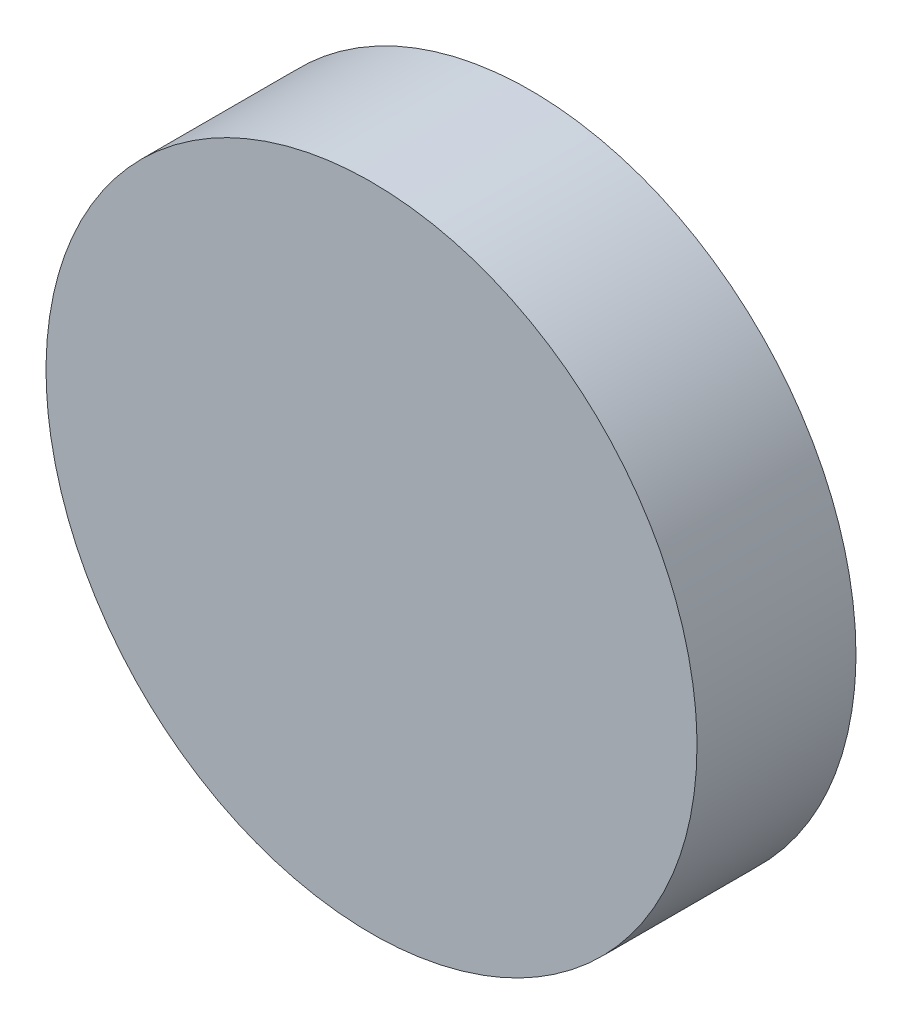
ISO-10303-21;
HEADER;
FILE_DESCRIPTION(('STEP AP214'),'2;1');
FILE_NAME('part.step','',(''),(''),'','','');
FILE_SCHEMA(('AUTOMOTIVE_DESIGN { 1 0 10303 214 1 1 1 1 }'));
ENDSEC;
DATA;
#1=APPLICATION_CONTEXT('core data for automotive mechanical design processes');
#2=APPLICATION_PROTOCOL_DEFINITION('international standard','automotive_design',2000,#1);
#3=PRODUCT_CONTEXT('',#1,'mechanical');
#4=PRODUCT('Part','Part','',(#3));
#5=PRODUCT_RELATED_PRODUCT_CATEGORY('part','',(#4));
#6=PRODUCT_DEFINITION_FORMATION('','',#4);
#7=PRODUCT_DEFINITION_CONTEXT('part definition',#1,'design');
#8=PRODUCT_DEFINITION('design','',#6,#7);
#9=PRODUCT_DEFINITION_SHAPE('','',#8);
#10=(LENGTH_UNIT() NAMED_UNIT(*) SI_UNIT(.MILLI.,.METRE.));
#11=(NAMED_UNIT(*) PLANE_ANGLE_UNIT() SI_UNIT($,.RADIAN.));
#12=(NAMED_UNIT(*) SI_UNIT($,.STERADIAN.) SOLID_ANGLE_UNIT());
#13=UNCERTAINTY_MEASURE_WITH_UNIT(LENGTH_MEASURE(1.E-05),#10,'distance_accuracy_value','');
#14=(GEOMETRIC_REPRESENTATION_CONTEXT(3) GLOBAL_UNCERTAINTY_ASSIGNED_CONTEXT((#13)) GLOBAL_UNIT_ASSIGNED_CONTEXT((#10,
#11,#12)) REPRESENTATION_CONTEXT('',''));
#15=CARTESIAN_POINT('',(0.,0.,0.));
#16=DIRECTION('',(0.,0.,1.));
#17=DIRECTION('',(1.,0.,0.));
#18=AXIS2_PLACEMENT_3D('',#15,#16,#17);
#19=CARTESIAN_POINT('',(-13.1496363943217,2.89844450659047,33.9946065263124));
#20=CARTESIAN_POINT('',(-13.1496363943217,3.16761247332292,33.9946065263124));
#21=CARTESIAN_POINT('',(-13.2567180692927,3.70594840678783,33.9946065263124));
#22=CARTESIAN_POINT('',(-13.7141322851876,4.39051715822122,33.9946065263124));
#23=CARTESIAN_POINT('',(-14.398701036621,4.8479313741161,33.9946065263124));
#24=CARTESIAN_POINT('',(-15.2062049368183,5.00855388657266,33.9946065263124));
#25=CARTESIAN_POINT('',(-16.0137088370157,4.8479313741161,33.9946065263124));
#26=CARTESIAN_POINT('',(-16.6982775884491,4.39051715822122,33.9946065263124));
#27=CARTESIAN_POINT('',(-17.155691804344,3.70594840678783,33.9946065263124));
#28=CARTESIAN_POINT('',(-17.3163143168005,2.89844450659047,33.9946065263124));
#29=CARTESIAN_POINT('',(-17.155691804344,2.09094060639311,33.9946065263124));
#30=CARTESIAN_POINT('',(-16.6982775884491,1.40637185495972,33.9946065263124));
#31=CARTESIAN_POINT('',(-16.0137088370157,0.948957639064841,33.9946065263124));
#32=CARTESIAN_POINT('',(-15.2062049368183,0.788335126608277,33.9946065263124));
#33=CARTESIAN_POINT('',(-14.398701036621,0.948957639064841,33.9946065263124));
#34=CARTESIAN_POINT('',(-13.7141322851876,1.40637185495972,33.9946065263124));
#35=CARTESIAN_POINT('',(-13.2567180692927,2.09094060639311,33.9946065263124));
#36=CARTESIAN_POINT('',(-13.1496363943217,2.62927653985802,33.9946065263124));
#37=CARTESIAN_POINT('',(-13.1496363943217,2.89844450659047,33.9946065263124));
#38=B_SPLINE_CURVE_WITH_KNOTS('',3,(#19,#20,#21,#22,#23,#24,#25,#26,#27,#28,#29,#30,#31,#32,#33,
#34,#35,#36,#37),.UNSPECIFIED.,.T.,.F.,(4,1,1,1,1,1,1,1,1,1,1,1,1,1,1,1,4),(0.,0.0625,0.125,
0.1875,0.25,0.3125,0.375,0.4375,0.5,0.5625,0.625,0.6875,0.75,0.8125,0.875,0.9375,1.),.UNSPECIFIED.);
#39=DIRECTION('',(0.,0.,1.));
#40=VECTOR('',#39,1.);
#41=SURFACE_OF_LINEAR_EXTRUSION('',#38,#40);
#42=CARTESIAN_POINT('',(-13.1496363943217,2.89844450659047,33.9946065263124));
#43=CARTESIAN_POINT('',(-13.1496363943217,3.16761247332292,33.9946065263124));
#44=CARTESIAN_POINT('',(-13.2567180692927,3.70594840678783,33.9946065263124));
#45=CARTESIAN_POINT('',(-13.7141322851876,4.39051715822122,33.9946065263124));
#46=CARTESIAN_POINT('',(-14.398701036621,4.8479313741161,33.9946065263124));
#47=CARTESIAN_POINT('',(-15.2062049368183,5.00855388657266,33.9946065263124));
#48=CARTESIAN_POINT('',(-16.0137088370157,4.8479313741161,33.9946065263124));
#49=CARTESIAN_POINT('',(-16.6982775884491,4.39051715822122,33.9946065263124));
#50=CARTESIAN_POINT('',(-17.155691804344,3.70594840678783,33.9946065263124));
#51=CARTESIAN_POINT('',(-17.3163143168005,2.89844450659047,33.9946065263124));
#52=CARTESIAN_POINT('',(-17.155691804344,2.09094060639311,33.9946065263124));
#53=CARTESIAN_POINT('',(-16.6982775884491,1.40637185495972,33.9946065263124));
#54=CARTESIAN_POINT('',(-16.0137088370157,0.948957639064841,33.9946065263124));
#55=CARTESIAN_POINT('',(-15.2062049368183,0.788335126608277,33.9946065263124));
#56=CARTESIAN_POINT('',(-14.398701036621,0.948957639064841,33.9946065263124));
#57=CARTESIAN_POINT('',(-13.7141322851876,1.40637185495972,33.9946065263124));
#58=CARTESIAN_POINT('',(-13.2567180692927,2.09094060639311,33.9946065263124));
#59=CARTESIAN_POINT('',(-13.1496363943217,2.62927653985802,33.9946065263124));
#60=CARTESIAN_POINT('',(-13.1496363943217,2.89844450659047,33.9946065263124));
#61=B_SPLINE_CURVE_WITH_KNOTS('',3,(#42,#43,#44,#45,#46,#47,#48,#49,#50,#51,#52,#53,#54,#55,#56,
#57,#58,#59,#60),.UNSPECIFIED.,.T.,.F.,(4,1,1,1,1,1,1,1,1,1,1,1,1,1,1,1,4),(0.,0.0625,0.125,
0.1875,0.25,0.3125,0.375,0.4375,0.5,0.5625,0.625,0.6875,0.75,0.8125,0.875,0.9375,1.),.UNSPECIFIED.);
#62=CARTESIAN_POINT('',(-13.1496363943217,2.89844450659047,33.9946065263124));
#63=VERTEX_POINT('',#62);
#64=EDGE_CURVE('E9',#63,#63,#61,.T.);
#65=ORIENTED_EDGE('',*,*,#64,.T.);
#66=EDGE_LOOP('',(#65));
#67=FACE_BOUND('',#66,.T.);
#68=CARTESIAN_POINT('',(-13.1496363943217,2.89844450659047,34.9990000000068));
#69=CARTESIAN_POINT('',(-13.1496363699629,2.86479771684749,34.9990000000068));
#70=CARTESIAN_POINT('',(-13.1504730064724,2.83115162548501,34.9990000000068));
#71=CARTESIAN_POINT('',(-13.1538034135198,2.76393947146804,34.9990000000068));
#72=CARTESIAN_POINT('',(-13.1562972815486,2.73037341363833,34.9990000000068));
#73=CARTESIAN_POINT('',(-13.1629261875652,2.66340163862288,34.9990000000068));
#74=CARTESIAN_POINT('',(-13.1670613381745,2.62999593259941,34.9990000000068));
#75=CARTESIAN_POINT('',(-13.1769569019658,2.56342468915356,34.9990000000068));
#76=CARTESIAN_POINT('',(-13.1827173852433,2.53025916215264,34.9990000000068));
#77=CARTESIAN_POINT('',(-13.1958477712335,2.46424824869611,34.9990000000068));
#78=CARTESIAN_POINT('',(-13.2032176739464,2.43140286224051,34.9990000000068));
#79=CARTESIAN_POINT('',(-13.2195510839073,2.36611217178674,34.9990000000068));
#80=CARTESIAN_POINT('',(-13.2285145224069,2.33366685059351,34.9990000000068));
#81=CARTESIAN_POINT('',(-13.2480191751394,2.26925627775602,34.9990000000068));
#82=CARTESIAN_POINT('',(-13.2585602810548,2.23729099331971,34.9990000000068));
#83=CARTESIAN_POINT('',(-13.2812044587058,2.17392037371882,34.9990000000068));
#84=CARTESIAN_POINT('',(-13.2933074385154,2.14251500572341,34.9990000000068));
#85=CARTESIAN_POINT('',(-13.3190592678828,2.08034458998414,34.9990000000068));
#86=CARTESIAN_POINT('',(-13.3327081174406,2.04957954224029,34.9990000000068));
#87=CARTESIAN_POINT('',(-13.3615060607773,1.98875789577373,34.9990000000068));
#88=CARTESIAN_POINT('',(-13.3766552427726,1.95870133883757,34.9990000000068));
#89=CARTESIAN_POINT('',(-13.4084085231704,1.89936431398903,34.9990000000068));
#90=CARTESIAN_POINT('',(-13.4250127213523,1.87008389948112,34.9990000000068));
#91=CARTESIAN_POINT('',(-13.4596307472126,1.8123669438299,34.9990000000068));
#92=CARTESIAN_POINT('',(-13.4776446356623,1.78393043914022,34.9990000000068));
#93=CARTESIAN_POINT('',(-13.5150368121087,1.72796909239188,34.9990000000068));
#94=CARTESIAN_POINT('',(-13.5344151001053,1.70044425033323,34.9990000000068));
#95=CARTESIAN_POINT('',(-13.5744908691528,1.64637404209053,34.9990000000068));
#96=CARTESIAN_POINT('',(-13.5951882932687,1.61982863371135,34.9990000000068));
#97=CARTESIAN_POINT('',(-13.6378571017135,1.56778513152689,34.9990000000068));
#98=CARTESIAN_POINT('',(-13.6598283985191,1.54228696597445,34.9990000000068));
#99=CARTESIAN_POINT('',(-13.7049997770275,1.49240569911345,34.9990000000068));
#100=CARTESIAN_POINT('',(-13.7281997863655,1.46802253229461,34.9990000000068));
#101=CARTESIAN_POINT('',(-13.7757829625225,1.42043935613767,34.9990000000068));
#102=CARTESIAN_POINT('',(-13.8001661293413,1.39723934679959,34.9990000000068));
#103=CARTESIAN_POINT('',(-13.8500473962023,1.3520679682912,34.9990000000068));
#104=CARTESIAN_POINT('',(-13.8755455617548,1.33009667148559,34.9990000000068));
#105=CARTESIAN_POINT('',(-13.9275890639392,1.28742786304083,34.9990000000068));
#106=CARTESIAN_POINT('',(-13.9541344723184,1.26673043892492,34.9990000000068));
#107=CARTESIAN_POINT('',(-14.0082046805611,1.22665466987745,34.9990000000068));
#108=CARTESIAN_POINT('',(-14.0357295226198,1.20727638188081,34.9990000000068));
#109=CARTESIAN_POINT('',(-14.091690869368,1.16988420543445,34.9990000000068));
#110=CARTESIAN_POINT('',(-14.1201273740576,1.15187031698473,34.9990000000068));
#111=CARTESIAN_POINT('',(-14.1778443297092,1.1172522911244,34.9990000000068));
#112=CARTESIAN_POINT('',(-14.2071247442177,1.10064809294253,34.9990000000068));
#113=CARTESIAN_POINT('',(-14.2664617690647,1.06889481254468,34.9990000000068));
#114=CARTESIAN_POINT('',(-14.2965183259987,1.05374563054928,34.9990000000068));
#115=CARTESIAN_POINT('',(-14.357339972471,1.02494768721292,34.9990000000068));
#116=CARTESIAN_POINT('',(-14.3881050202227,1.01129883765558,34.9990000000068));
#117=CARTESIAN_POINT('',(-14.4502754359406,0.985547008286876,34.9990000000068));
#118=CARTESIAN_POINT('',(-14.4816808039067,0.973444028475515,34.9990000000068));
#119=CARTESIAN_POINT('',(-14.5450514235876,0.950799850829384,34.9990000000068));
#120=CARTESIAN_POINT('',(-14.5770167081331,0.940258744920572,34.9990000000068));
#121=CARTESIAN_POINT('',(-14.6414272806721,0.920754092170061,34.9990000000068));
#122=CARTESIAN_POINT('',(-14.6738726014576,0.911790653645731,34.9990000000068));
#123=CARTESIAN_POINT('',(-14.7391632930254,0.895457243752155,34.9990000000068));
#124=CARTESIAN_POINT('',(-14.772008681003,0.888087341131276,34.9990000000068));
#125=CARTESIAN_POINT('',(-14.8380195903015,0.874956954889819,34.9990000000068));
#126=CARTESIAN_POINT('',(-14.8711851116225,0.869196471269239,34.9990000000068));
#127=CARTESIAN_POINT('',(-14.9377563705859,0.85930090841536,34.9990000000068));
#128=CARTESIAN_POINT('',(-14.9711620978056,0.855165759086547,34.9990000000068));
#129=CARTESIAN_POINT('',(-15.0381338149133,0.84853684957166,34.9990000000068));
#130=CARTESIAN_POINT('',(-15.071699793646,0.846042976764422,34.9990000000068));
#131=CARTESIAN_POINT('',(-15.1389121637564,0.842712582771656,34.9990000000068));
#132=CARTESIAN_POINT('',(-15.1725585502874,0.841875964093798,34.9990000000068));
#133=CARTESIAN_POINT('',(-15.2398513233493,0.841875964093798,34.9990000000068));
#134=CARTESIAN_POINT('',(-15.2734977098803,0.842712582771656,34.9990000000068));
#135=CARTESIAN_POINT('',(-15.3407100799907,0.846042976764422,34.9990000000068));
#136=CARTESIAN_POINT('',(-15.3742760587233,0.84853684957166,34.9990000000068));
#137=CARTESIAN_POINT('',(-15.4412477758311,0.855165759086547,34.9990000000068));
#138=CARTESIAN_POINT('',(-15.4746535030508,0.85930090841536,34.9990000000068));
#139=CARTESIAN_POINT('',(-15.5412247620142,0.869196471269239,34.9990000000068));
#140=CARTESIAN_POINT('',(-15.5743902833352,0.874956954889818,34.9990000000068));
#141=CARTESIAN_POINT('',(-15.6404011926337,0.888087341131276,34.9990000000068));
#142=CARTESIAN_POINT('',(-15.6732465806113,0.895457243752154,34.9990000000068));
#143=CARTESIAN_POINT('',(-15.7385372721791,0.911790653645731,34.9990000000068));
#144=CARTESIAN_POINT('',(-15.7709825929646,0.920754092170061,34.9990000000068));
#145=CARTESIAN_POINT('',(-15.8353931655035,0.940258744920571,34.9990000000068));
#146=CARTESIAN_POINT('',(-15.8673584500491,0.950799850829384,34.9990000000068));
#147=CARTESIAN_POINT('',(-15.93072906973,0.973444028475515,34.9990000000068));
#148=CARTESIAN_POINT('',(-15.9621344376961,0.985547008286875,34.9990000000068));
#149=CARTESIAN_POINT('',(-16.024304853414,1.01129883765558,34.9990000000068));
#150=CARTESIAN_POINT('',(-16.0550699011656,1.02494768721292,34.9990000000068));
#151=CARTESIAN_POINT('',(-16.115891547638,1.05374563054928,34.9990000000068));
#152=CARTESIAN_POINT('',(-16.145948104572,1.06889481254468,34.9990000000068));
#153=CARTESIAN_POINT('',(-16.205285129419,1.10064809294253,34.9990000000068));
#154=CARTESIAN_POINT('',(-16.2345655439275,1.1172522911244,34.9990000000068));
#155=CARTESIAN_POINT('',(-16.2922824995791,1.15187031698473,34.9990000000068));
#156=CARTESIAN_POINT('',(-16.3207190042686,1.16988420543445,34.9990000000068));
#157=CARTESIAN_POINT('',(-16.3766803510169,1.20727638188081,34.9990000000068));
#158=CARTESIAN_POINT('',(-16.4042051930756,1.22665466987745,34.9990000000068));
#159=CARTESIAN_POINT('',(-16.4582754013183,1.26673043892492,34.9990000000068));
#160=CARTESIAN_POINT('',(-16.4848208096975,1.28742786304083,34.9990000000068));
#161=CARTESIAN_POINT('',(-16.5368643118819,1.33009667148559,34.9990000000068));
#162=CARTESIAN_POINT('',(-16.5623624774344,1.3520679682912,34.9990000000068));
#163=CARTESIAN_POINT('',(-16.6122437442954,1.39723934679959,34.9990000000068));
#164=CARTESIAN_POINT('',(-16.6366269111142,1.42043935613767,34.9990000000068));
#165=CARTESIAN_POINT('',(-16.6842100872711,1.46802253229461,34.9990000000068));
#166=CARTESIAN_POINT('',(-16.7074100966092,1.49240569911345,34.9990000000068));
#167=CARTESIAN_POINT('',(-16.7525814751176,1.54228696597445,34.9990000000068));
#168=CARTESIAN_POINT('',(-16.7745527719232,1.56778513152689,34.9990000000068));
#169=CARTESIAN_POINT('',(-16.817221580368,1.61982863371135,34.9990000000068));
#170=CARTESIAN_POINT('',(-16.8379190044839,1.64637404209051,34.9990000000068));
#171=CARTESIAN_POINT('',(-16.8779947735314,1.70044425033325,34.9990000000068));
#172=CARTESIAN_POINT('',(-16.897373061528,1.72796909239194,34.9990000000068));
#173=CARTESIAN_POINT('',(-16.9347652379744,1.78393043914016,34.9990000000068));
#174=CARTESIAN_POINT('',(-16.9527791264241,1.8123669438297,34.9990000000068));
#175=CARTESIAN_POINT('',(-16.9873971522844,1.87008389948133,34.9990000000068));
#176=CARTESIAN_POINT('',(-17.0040013504663,1.8993643139898,34.9990000000068));
#177=CARTESIAN_POINT('',(-17.0357546308641,1.9587013388368,34.9990000000068));
#178=CARTESIAN_POINT('',(-17.0509038128595,1.98875789577086,34.9990000000068));
#179=CARTESIAN_POINT('',(-17.0797017561959,2.04957954224316,34.9990000000068));
#180=CARTESIAN_POINT('',(-17.0933506057532,2.08034458999486,34.9990000000068));
#181=CARTESIAN_POINT('',(-17.1191024351219,2.14251500571269,34.9990000000068));
#182=CARTESIAN_POINT('',(-17.1312054149333,2.17392037367883,34.9990000000068));
#183=CARTESIAN_POINT('',(-17.1538495925794,2.2372909933597,34.9990000000068));
#184=CARTESIAN_POINT('',(-17.1643906984882,2.26925627790526,34.9990000000068));
#185=CARTESIAN_POINT('',(-17.1838953512387,2.33366685044426,34.9990000000068));
#186=CARTESIAN_POINT('',(-17.1928587897631,2.36611217122972,34.9990000000068));
#187=CARTESIAN_POINT('',(-17.2091921996567,2.43140286279756,34.9990000000068));
#188=CARTESIAN_POINT('',(-17.2165621022775,2.4642482507751,34.9990000000068));
#189=CARTESIAN_POINT('',(-17.229692488519,2.53025916007365,34.9990000000068));
#190=CARTESIAN_POINT('',(-17.2354529721396,2.56342468139465,34.9990000000068));
#191=CARTESIAN_POINT('',(-17.2453485349934,2.62999594035798,34.9990000000068));
#192=CARTESIAN_POINT('',(-17.2494836843223,2.66340166757772,34.9990000000068));
#193=CARTESIAN_POINT('',(-17.2561125938372,2.73037338468548,34.9990000000068));
#194=CARTESIAN_POINT('',(-17.2586064666444,2.76393936341814,34.9990000000068));
#195=CARTESIAN_POINT('',(-17.2619368606372,2.83115173352855,34.9990000000068));
#196=CARTESIAN_POINT('',(-17.262773479315,2.86479812005951,34.9990000000068));
#197=CARTESIAN_POINT('',(-17.262773479315,2.93209089312143,34.9990000000068));
#198=CARTESIAN_POINT('',(-17.2619368606372,2.96573727965239,34.9990000000068));
#199=CARTESIAN_POINT('',(-17.2586064666444,3.0329496497628,34.9990000000068));
#200=CARTESIAN_POINT('',(-17.2561125938372,3.06651562849546,34.9990000000068));
#201=CARTESIAN_POINT('',(-17.2494836843223,3.13348734560323,34.9990000000068));
#202=CARTESIAN_POINT('',(-17.2453485349935,3.16689307282296,34.9990000000068));
#203=CARTESIAN_POINT('',(-17.2354529721396,3.23346433178629,34.9990000000068));
#204=CARTESIAN_POINT('',(-17.229692488519,3.26662985310729,34.9990000000068));
#205=CARTESIAN_POINT('',(-17.2165621022775,3.33264076240584,34.9990000000068));
#206=CARTESIAN_POINT('',(-17.2091921996567,3.36548615038338,34.9990000000068));
#207=CARTESIAN_POINT('',(-17.1928587897631,3.43077684195123,34.9990000000068));
#208=CARTESIAN_POINT('',(-17.1838953512387,3.46322216273668,34.9990000000068));
#209=CARTESIAN_POINT('',(-17.1643906984882,3.52763273527568,34.9990000000068));
#210=CARTESIAN_POINT('',(-17.1538495925794,3.55959801982124,34.9990000000068));
#211=CARTESIAN_POINT('',(-17.1312054149333,3.62296863950211,34.9990000000068));
#212=CARTESIAN_POINT('',(-17.1191024351219,3.65437400746825,34.9990000000068));
#213=CARTESIAN_POINT('',(-17.0933506057532,3.71654442318609,34.9990000000068));
#214=CARTESIAN_POINT('',(-17.0797017561959,3.74730947093778,34.9990000000068));
#215=CARTESIAN_POINT('',(-17.0509038128595,3.80813111741008,34.9990000000068));
#216=CARTESIAN_POINT('',(-17.0357546308641,3.83818767434414,34.9990000000068));
#217=CARTESIAN_POINT('',(-17.0040013504663,3.89752469919114,34.9990000000068));
#218=CARTESIAN_POINT('',(-16.9873971522844,3.92680511369961,34.9990000000068));
#219=CARTESIAN_POINT('',(-16.9527791264241,3.98452206935124,34.9990000000068));
#220=CARTESIAN_POINT('',(-16.9347652379744,4.01295857404078,34.9990000000068));
#221=CARTESIAN_POINT('',(-16.897373061528,4.068919920789,34.9990000000068));
#222=CARTESIAN_POINT('',(-16.8779947735314,4.09644476284769,34.9990000000068));
#223=CARTESIAN_POINT('',(-16.8379190044839,4.15051497109043,34.9990000000068));
#224=CARTESIAN_POINT('',(-16.817221580368,4.17706037946959,34.9990000000068));
#225=CARTESIAN_POINT('',(-16.7745527719232,4.22910388165405,34.9990000000068));
#226=CARTESIAN_POINT('',(-16.7525814751176,4.25460204720649,34.9990000000068));
#227=CARTESIAN_POINT('',(-16.7074100966092,4.30448331406749,34.9990000000068));
#228=CARTESIAN_POINT('',(-16.6842100872711,4.32886648088633,34.9990000000068));
#229=CARTESIAN_POINT('',(-16.6366269111142,4.37644965704327,34.9990000000068));
#230=CARTESIAN_POINT('',(-16.6122437442954,4.39964966638135,34.9990000000068));
#231=CARTESIAN_POINT('',(-16.5623624774344,4.44482104488974,34.9990000000068));
#232=CARTESIAN_POINT('',(-16.5368643118819,4.46679234169535,34.9990000000068));
#233=CARTESIAN_POINT('',(-16.4848208096975,4.50946115014011,34.9990000000068));
#234=CARTESIAN_POINT('',(-16.4582754013183,4.53015857425602,34.9990000000068));
#235=CARTESIAN_POINT('',(-16.4042051930756,4.57023434330349,34.9990000000068));
#236=CARTESIAN_POINT('',(-16.3766803510169,4.58961263130013,34.9990000000068));
#237=CARTESIAN_POINT('',(-16.3207190042686,4.62700480774649,34.9990000000068));
#238=CARTESIAN_POINT('',(-16.2922824995791,4.64501869619621,34.9990000000068));
#239=CARTESIAN_POINT('',(-16.2345655439275,4.67963672205654,34.9990000000068));
#240=CARTESIAN_POINT('',(-16.205285129419,4.69624092023841,34.9990000000068));
#241=CARTESIAN_POINT('',(-16.145948104572,4.72799420063626,34.9990000000068));
#242=CARTESIAN_POINT('',(-16.115891547638,4.74314338263166,34.9990000000068));
#243=CARTESIAN_POINT('',(-16.0550699011656,4.77194132596803,34.9990000000068));
#244=CARTESIAN_POINT('',(-16.024304853414,4.78559017552536,34.9990000000068));
#245=CARTESIAN_POINT('',(-15.9621344376961,4.81134200489407,34.9990000000068));
#246=CARTESIAN_POINT('',(-15.93072906973,4.82344498470543,34.9990000000068));
#247=CARTESIAN_POINT('',(-15.8673584500491,4.84608916235156,34.9990000000068));
#248=CARTESIAN_POINT('',(-15.8353931655035,4.85663026826037,34.9990000000068));
#249=CARTESIAN_POINT('',(-15.7709825929646,4.87613492101088,34.9990000000068));
#250=CARTESIAN_POINT('',(-15.7385372721791,4.88509835953521,34.9990000000068));
#251=CARTESIAN_POINT('',(-15.6732465806113,4.90143176942879,34.9990000000068));
#252=CARTESIAN_POINT('',(-15.6404011926337,4.90880167204967,34.9990000000068));
#253=CARTESIAN_POINT('',(-15.5743902833352,4.92193205829112,34.9990000000068));
#254=CARTESIAN_POINT('',(-15.5412247620142,4.9276925419117,34.9990000000068));
#255=CARTESIAN_POINT('',(-15.4746535030508,4.93758810476558,34.9990000000068));
#256=CARTESIAN_POINT('',(-15.4412477758311,4.94172325409439,34.9990000000068));
#257=CARTESIAN_POINT('',(-15.3742760587233,4.94835216360928,34.9990000000068));
#258=CARTESIAN_POINT('',(-15.3407100799907,4.95084603641652,34.9990000000068));
#259=CARTESIAN_POINT('',(-15.2734977098803,4.95417643040929,34.9990000000068));
#260=CARTESIAN_POINT('',(-15.2398513233493,4.95501304908714,34.9990000000068));
#261=CARTESIAN_POINT('',(-15.1725585502874,4.95501304908714,34.9990000000068));
#262=CARTESIAN_POINT('',(-15.1389121637564,4.95417643040928,34.9990000000068));
#263=CARTESIAN_POINT('',(-15.071699793646,4.95084603641652,34.9990000000068));
#264=CARTESIAN_POINT('',(-15.0381338149133,4.94835216360928,34.9990000000068));
#265=CARTESIAN_POINT('',(-14.9711620978056,4.94172325409439,34.9990000000068));
#266=CARTESIAN_POINT('',(-14.9377563705859,4.93758810476558,34.9990000000068));
#267=CARTESIAN_POINT('',(-14.8711851116225,4.9276925419117,34.9990000000068));
#268=CARTESIAN_POINT('',(-14.8380195903015,4.92193205829112,34.9990000000068));
#269=CARTESIAN_POINT('',(-14.772008681003,4.90880167204967,34.9990000000068));
#270=CARTESIAN_POINT('',(-14.7391632930254,4.90143176942879,34.9990000000068));
#271=CARTESIAN_POINT('',(-14.6738726014576,4.88509835953521,34.9990000000068));
#272=CARTESIAN_POINT('',(-14.6414272806721,4.87613492101088,34.9990000000068));
#273=CARTESIAN_POINT('',(-14.5770167081331,4.85663026826037,34.9990000000068));
#274=CARTESIAN_POINT('',(-14.5450514235876,4.84608916235156,34.9990000000068));
#275=CARTESIAN_POINT('',(-14.4816808039067,4.82344498470543,34.9990000000068));
#276=CARTESIAN_POINT('',(-14.4502754359406,4.81134200489407,34.9990000000068));
#277=CARTESIAN_POINT('',(-14.3881050202227,4.78559017552537,34.9990000000068));
#278=CARTESIAN_POINT('',(-14.357339972471,4.77194132596803,34.9990000000068));
#279=CARTESIAN_POINT('',(-14.2965183259987,4.74314338263166,34.9990000000068));
#280=CARTESIAN_POINT('',(-14.2664617690647,4.72799420063626,34.9990000000068));
#281=CARTESIAN_POINT('',(-14.2071247442177,4.69624092023841,34.9990000000068));
#282=CARTESIAN_POINT('',(-14.1778443297092,4.67963672205654,34.9990000000068));
#283=CARTESIAN_POINT('',(-14.1201273740576,4.64501869619621,34.9990000000068));
#284=CARTESIAN_POINT('',(-14.091690869368,4.62700480774649,34.9990000000068));
#285=CARTESIAN_POINT('',(-14.0357295226198,4.58961263130013,34.9990000000068));
#286=CARTESIAN_POINT('',(-14.0082046805611,4.57023434330349,34.9990000000068));
#287=CARTESIAN_POINT('',(-13.9541344723184,4.53015857425603,34.9990000000068));
#288=CARTESIAN_POINT('',(-13.9275890639392,4.50946115014011,34.9990000000068));
#289=CARTESIAN_POINT('',(-13.8755455617548,4.46679234169535,34.9990000000068));
#290=CARTESIAN_POINT('',(-13.8500473962023,4.44482104488974,34.9990000000068));
#291=CARTESIAN_POINT('',(-13.8001661293413,4.39964966638136,34.9990000000068));
#292=CARTESIAN_POINT('',(-13.7757829625225,4.37644965704327,34.9990000000068));
#293=CARTESIAN_POINT('',(-13.7281997863655,4.32886648088634,34.9990000000068));
#294=CARTESIAN_POINT('',(-13.7049997770275,4.30448331406749,34.9990000000068));
#295=CARTESIAN_POINT('',(-13.6598283985191,4.25460204720649,34.9990000000068));
#296=CARTESIAN_POINT('',(-13.6378571017135,4.22910388165405,34.9990000000068));
#297=CARTESIAN_POINT('',(-13.5951882932687,4.17706037946959,34.9990000000068));
#298=CARTESIAN_POINT('',(-13.5744908691528,4.15051497109042,34.9990000000068));
#299=CARTESIAN_POINT('',(-13.5344151001053,4.09644476284771,34.9990000000068));
#300=CARTESIAN_POINT('',(-13.5150368121087,4.06891992078906,34.9990000000068));
#301=CARTESIAN_POINT('',(-13.4776446356623,4.01295857404072,34.9990000000068));
#302=CARTESIAN_POINT('',(-13.4596307472126,3.98452206935104,34.9990000000068));
#303=CARTESIAN_POINT('',(-13.4250127213523,3.92680511369982,34.9990000000068));
#304=CARTESIAN_POINT('',(-13.4084085231704,3.89752469919191,34.9990000000068));
#305=CARTESIAN_POINT('',(-13.3766552427726,3.83818767434337,34.9990000000068));
#306=CARTESIAN_POINT('',(-13.3615060607773,3.80813111740721,34.9990000000068));
#307=CARTESIAN_POINT('',(-13.3327081174406,3.74730947094065,34.9990000000068));
#308=CARTESIAN_POINT('',(-13.3190592678828,3.7165444231968,34.9990000000068));
#309=CARTESIAN_POINT('',(-13.2933074385154,3.65437400745754,34.9990000000068));
#310=CARTESIAN_POINT('',(-13.2812044587058,3.62296863946212,34.9990000000068));
#311=CARTESIAN_POINT('',(-13.2585602810548,3.55959801986123,34.9990000000068));
#312=CARTESIAN_POINT('',(-13.2480191751394,3.52763273542492,34.9990000000068));
#313=CARTESIAN_POINT('',(-13.2285145224069,3.46322216258743,34.9990000000068));
#314=CARTESIAN_POINT('',(-13.2195510839073,3.4307768413942,34.9990000000068));
#315=CARTESIAN_POINT('',(-13.2032176739464,3.36548615094044,34.9990000000068));
#316=CARTESIAN_POINT('',(-13.1958477712335,3.33264076448483,34.9990000000068));
#317=CARTESIAN_POINT('',(-13.1827173852433,3.2666298510283,34.9990000000068));
#318=CARTESIAN_POINT('',(-13.1769569019658,3.23346432402738,34.9990000000068));
#319=CARTESIAN_POINT('',(-13.1670613381745,3.16689308058154,34.9990000000068));
#320=CARTESIAN_POINT('',(-13.1629261875652,3.13348737455806,34.9990000000068));
#321=CARTESIAN_POINT('',(-13.1562972815486,3.06651559954261,34.9990000000068));
#322=CARTESIAN_POINT('',(-13.1538034135198,3.03294954171291,34.9990000000068));
#323=CARTESIAN_POINT('',(-13.1504730064724,2.96573738769594,34.9990000000068));
#324=CARTESIAN_POINT('',(-13.1496363699629,2.93209129633345,34.9990000000068));
#325=CARTESIAN_POINT('',(-13.1496363943217,2.89844450659047,34.9990000000068));
#326=B_SPLINE_CURVE_WITH_KNOTS('',3,(#68,#69,#70,#71,#72,#73,#74,#75,#76,#77,#78,#79,#80,#81,
#82,#83,#84,#85,#86,#87,#88,#89,#90,#91,#92,#93,#94,#95,#96,#97,#98,#99,#100,#101,#102,#103,
#104,#105,#106,#107,#108,#109,#110,#111,#112,#113,#114,#115,#116,#117,#118,#119,#120,#121,#122,
#123,#124,#125,#126,#127,#128,#129,#130,#131,#132,#133,#134,#135,#136,#137,#138,#139,#140,#141,
#142,#143,#144,#145,#146,#147,#148,#149,#150,#151,#152,#153,#154,#155,#156,#157,#158,#159,#160,
#161,#162,#163,#164,#165,#166,#167,#168,#169,#170,#171,#172,#173,#174,#175,#176,#177,#178,#179,
#180,#181,#182,#183,#184,#185,#186,#187,#188,#189,#190,#191,#192,#193,#194,#195,#196,#197,#198,
#199,#200,#201,#202,#203,#204,#205,#206,#207,#208,#209,#210,#211,#212,#213,#214,#215,#216,#217,
#218,#219,#220,#221,#222,#223,#224,#225,#226,#227,#228,#229,#230,#231,#232,#233,#234,#235,#236,
#237,#238,#239,#240,#241,#242,#243,#244,#245,#246,#247,#248,#249,#250,#251,#252,#253,#254,#255,
#256,#257,#258,#259,#260,#261,#262,#263,#264,#265,#266,#267,#268,#269,#270,#271,#272,#273,#274,
#275,#276,#277,#278,#279,#280,#281,#282,#283,#284,#285,#286,#287,#288,#289,#290,#291,#292,#293,
#294,#295,#296,#297,#298,#299,#300,#301,#302,#303,#304,#305,#306,#307,#308,#309,#310,#311,#312,
#313,#314,#315,#316,#317,#318,#319,#320,#321,#322,#323,#324,#325),.UNSPECIFIED.,.F.,.F.,(4,2,2,
2,2,2,2,2,2,2,2,2,2,2,2,2,2,2,2,2,2,2,2,2,2,2,2,2,2,2,2,2,2,2,2,2,2,2,2,2,2,2,2,2,2,2,2,2,2,2,2,
2,2,2,2,2,2,2,2,2,2,2,2,2,2,2,2,2,2,2,2,2,2,2,2,2,2,2,2,2,2,2,2,2,2,2,2,2,2,2,2,2,2,2,2,2,2,2,2,
2,2,2,2,2,2,2,2,2,2,2,2,2,2,2,2,2,2,2,2,2,2,2,2,2,2,2,2,2,4),(0.,0.100928980478611,
0.201863898895515,0.302805744465615,0.403751944002991,0.504698143540367,0.605639989110467,
0.706574907527371,0.807503888005981,0.908432868484594,1.0093677869015,1.1103096324716,
1.21125583200897,1.31220203154635,1.41314387711645,1.51407879553335,1.61500777601196,
1.71593675649058,1.81687167490748,1.91781352047758,2.01875972001496,2.11970591955233,
2.22064776512243,2.32158268353933,2.42251166401795,2.52344064449656,2.62437556291346,
2.72531740848356,2.82626360802094,2.92720980755831,3.02815165312841,3.12908657154532,
3.23001555202393,3.33094453250254,3.43187945091944,3.53282129648954,3.63376749602692,
3.7347136955643,3.8356555411344,3.9365904595513,4.03751944002991,4.13844842050852,
4.23938333892542,4.34032518449553,4.4412713840329,4.54221758357028,4.64315942914038,
4.74409434755729,4.84502332803589,4.9459523085145,5.04688722693141,5.14782907250151,
5.24877527203888,5.34972147157626,5.45066331714636,5.55159823556326,5.65252721604187,
5.75345619652049,5.85439111493739,5.95533296050749,6.05627916004487,6.15722535958224,
6.25816720515234,6.35910212356925,6.46003110404786,6.56096008452647,6.66189500294337,
6.76283684851347,6.86378304805085,6.96472924758823,7.06567109315833,7.16660601157523,
7.26753499205384,7.36846397253245,7.46939889094936,7.57034073651946,7.67128693605683,
7.77223313559421,7.87317498116431,7.97410989958121,8.07503888005982,8.17596786053844,
8.27690277895534,8.37784462452544,8.47879082406281,8.57973702360019,8.68067886917029,
8.7816137875872,8.8825427680658,8.98347174854441,9.08440666696132,9.18534851253142,
9.2862947120688,9.38724091160618,9.48818275717627,9.58911767559318,9.69004665607179,
9.7909756365504,9.8919105549673,9.9928524005374,10.0937986000748,10.1947447996122,
10.2956866451823,10.3966215635992,10.4975505440778,10.5984795245564,10.6994144429733,
10.8003562885434,10.9013024880808,11.0022486876181,11.1031905331882,11.2041254516051,
11.3050544320838,11.4059834125624,11.5069183309793,11.6078601765494,11.7088063760867,
11.8097525756241,11.9106944211942,12.0116293396111,12.1125583200897,12.2134873005683,
12.3144222189853,12.4153640645554,12.5163102640927,12.6172564636301,12.7181983092002,
12.8191332276171,12.9200622080957),.UNSPECIFIED.);
#327=CARTESIAN_POINT('',(-13.1496363943217,2.89844450659047,34.9990000000068));
#328=VERTEX_POINT('',#327);
#329=EDGE_CURVE('E24',#328,#328,#326,.F.);
#330=ORIENTED_EDGE('',*,*,#329,.F.);
#331=EDGE_LOOP('',(#330));
#332=FACE_BOUND('',#331,.T.);
#333=ADVANCED_FACE('F14',(#67,#332),#41,.T.);
#334=CARTESIAN_POINT('',(-11.7062049368191,2.89844450659127,33.9946065263124));
#335=DIRECTION('',(0.,0.,1.));
#336=DIRECTION('',(0.,-1.,0.));
#337=AXIS2_PLACEMENT_3D('',#334,#335,#336);
#338=PLANE('',#337);
#339=ORIENTED_EDGE('',*,*,#64,.F.);
#340=EDGE_LOOP('',(#339));
#341=FACE_BOUND('',#340,.T.);
#342=ADVANCED_FACE('F62',(#341),#338,.F.);
#343=CARTESIAN_POINT('',(-11.7062049368191,2.89844450659127,34.9990000000068));
#344=DIRECTION('',(0.,0.,1.));
#345=DIRECTION('',(0.,-1.,0.));
#346=AXIS2_PLACEMENT_3D('',#343,#344,#345);
#347=PLANE('',#346);
#348=ORIENTED_EDGE('',*,*,#329,.T.);
#349=EDGE_LOOP('',(#348));
#350=FACE_BOUND('',#349,.T.);
#351=ADVANCED_FACE('F31',(#350),#347,.T.);
#352=CLOSED_SHELL('',(#333,#342,#351));
#353=MANIFOLD_SOLID_BREP('B1',#352);
#354=ADVANCED_BREP_SHAPE_REPRESENTATION('',(#18,#353),#14);
#355=SHAPE_DEFINITION_REPRESENTATION(#9,#354);
ENDSEC;
END-ISO-10303-21;
